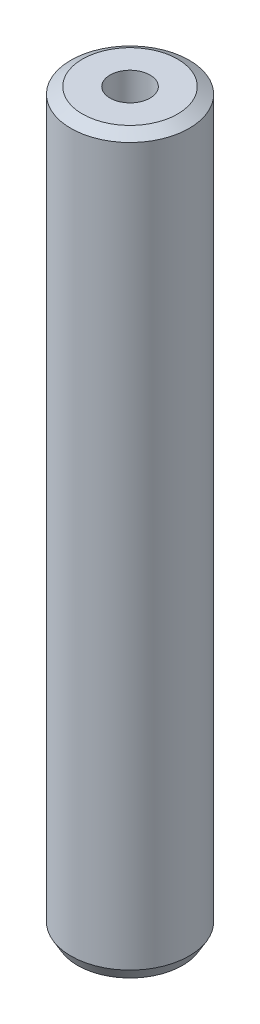
ISO-10303-21;
HEADER;
FILE_DESCRIPTION(('STEP AP214'),'2;1');
FILE_NAME('part.step','',(''),(''),'','','');
FILE_SCHEMA(('AUTOMOTIVE_DESIGN { 1 0 10303 214 1 1 1 1 }'));
ENDSEC;
DATA;
#1=APPLICATION_CONTEXT('core data for automotive mechanical design processes');
#2=APPLICATION_PROTOCOL_DEFINITION('international standard','automotive_design',2000,#1);
#3=PRODUCT_CONTEXT('',#1,'mechanical');
#4=PRODUCT('Part','Part','',(#3));
#5=PRODUCT_RELATED_PRODUCT_CATEGORY('part','',(#4));
#6=PRODUCT_DEFINITION_FORMATION('','',#4);
#7=PRODUCT_DEFINITION_CONTEXT('part definition',#1,'design');
#8=PRODUCT_DEFINITION('design','',#6,#7);
#9=PRODUCT_DEFINITION_SHAPE('','',#8);
#10=(LENGTH_UNIT() NAMED_UNIT(*) SI_UNIT(.MILLI.,.METRE.));
#11=(NAMED_UNIT(*) PLANE_ANGLE_UNIT() SI_UNIT($,.RADIAN.));
#12=(NAMED_UNIT(*) SI_UNIT($,.STERADIAN.) SOLID_ANGLE_UNIT());
#13=UNCERTAINTY_MEASURE_WITH_UNIT(LENGTH_MEASURE(1.E-05),#10,'distance_accuracy_value','');
#14=(GEOMETRIC_REPRESENTATION_CONTEXT(3) GLOBAL_UNCERTAINTY_ASSIGNED_CONTEXT((#13)) GLOBAL_UNIT_ASSIGNED_CONTEXT((#10,
#11,#12)) REPRESENTATION_CONTEXT('',''));
#15=CARTESIAN_POINT('',(0.,0.,0.));
#16=DIRECTION('',(0.,0.,1.));
#17=DIRECTION('',(1.,0.,0.));
#18=AXIS2_PLACEMENT_3D('',#15,#16,#17);
#19=CARTESIAN_POINT('',(0.,465.942837783253,0.));
#20=DIRECTION('',(0.,-1.,0.));
#21=DIRECTION('',(0.,0.,-1.));
#22=AXIS2_PLACEMENT_3D('',#19,#20,#21);
#23=CYLINDRICAL_SURFACE('',#22,37.5);
#24=CARTESIAN_POINT('',(0.,461.716864130824,0.));
#25=DIRECTION('',(0.,1.,0.));
#26=DIRECTION('',(0.,0.,1.));
#27=AXIS2_PLACEMENT_3D('',#24,#25,#26);
#28=CIRCLE('',#27,37.5);
#29=CARTESIAN_POINT('',(0.,461.716864130824,-37.5));
#30=VERTEX_POINT('',#29);
#31=EDGE_CURVE('E50',#30,#30,#28,.F.);
#32=CARTESIAN_POINT('',(0.,7.31960107745549,0.));
#33=DIRECTION('',(0.,1.,0.));
#34=DIRECTION('',(0.,0.,1.));
#35=AXIS2_PLACEMENT_3D('',#32,#33,#34);
#36=CIRCLE('',#35,37.5);
#37=CARTESIAN_POINT('',(0.,7.31960107745544,-37.5));
#38=VERTEX_POINT('',#37);
#39=EDGE_CURVE('E51',#38,#38,#36,.T.);
#40=CARTESIAN_POINT('',(0.,461.716864130824,-37.5));
#41=CARTESIAN_POINT('',(0.,456.983559307351,-37.5));
#42=CARTESIAN_POINT('',(0.,452.250254483879,-37.5));
#43=CARTESIAN_POINT('',(0.,442.783644836934,-37.5));
#44=CARTESIAN_POINT('',(0.,438.050340013461,-37.5));
#45=CARTESIAN_POINT('',(0.,428.583730366516,-37.5));
#46=CARTESIAN_POINT('',(0.,423.850425543043,-37.5));
#47=CARTESIAN_POINT('',(0.,414.383815896098,-37.5));
#48=CARTESIAN_POINT('',(0.,409.650511072625,-37.5));
#49=CARTESIAN_POINT('',(0.,400.18390142568,-37.5));
#50=CARTESIAN_POINT('',(0.,395.450596602208,-37.5));
#51=CARTESIAN_POINT('',(0.,385.983986955263,-37.5));
#52=CARTESIAN_POINT('',(0.,381.25068213179,-37.5));
#53=CARTESIAN_POINT('',(0.,371.784072484845,-37.5));
#54=CARTESIAN_POINT('',(0.,367.050767661372,-37.5));
#55=CARTESIAN_POINT('',(0.,357.584158014427,-37.5));
#56=CARTESIAN_POINT('',(0.,352.850853190954,-37.5));
#57=CARTESIAN_POINT('',(0.,343.384243544009,-37.5));
#58=CARTESIAN_POINT('',(0.,338.650938720537,-37.5));
#59=CARTESIAN_POINT('',(0.,329.184329073591,-37.5));
#60=CARTESIAN_POINT('',(0.,324.451024250119,-37.5));
#61=CARTESIAN_POINT('',(0.,314.984414603174,-37.5));
#62=CARTESIAN_POINT('',(0.,310.251109779701,-37.5));
#63=CARTESIAN_POINT('',(0.,300.784500132756,-37.5));
#64=CARTESIAN_POINT('',(0.,296.051195309283,-37.5));
#65=CARTESIAN_POINT('',(0.,286.584585662338,-37.5));
#66=CARTESIAN_POINT('',(0.,281.851280838866,-37.5));
#67=CARTESIAN_POINT('',(0.,272.38467119192,-37.5));
#68=CARTESIAN_POINT('',(0.,267.651366368448,-37.5));
#69=CARTESIAN_POINT('',(0.,258.184756721503,-37.5));
#70=CARTESIAN_POINT('',(0.,253.45145189803,-37.5));
#71=CARTESIAN_POINT('',(0.,243.984842251085,-37.5));
#72=CARTESIAN_POINT('',(0.,239.251537427612,-37.5));
#73=CARTESIAN_POINT('',(0.,229.784927780667,-37.5));
#74=CARTESIAN_POINT('',(0.,225.051622957194,-37.5));
#75=CARTESIAN_POINT('',(0.,215.585013310249,-37.5));
#76=CARTESIAN_POINT('',(0.,210.851708486777,-37.5));
#77=CARTESIAN_POINT('',(0.,201.385098839832,-37.5));
#78=CARTESIAN_POINT('',(0.,196.651794016359,-37.5));
#79=CARTESIAN_POINT('',(0.,187.185184369414,-37.5));
#80=CARTESIAN_POINT('',(0.,182.451879545941,-37.5));
#81=CARTESIAN_POINT('',(0.,172.985269898996,-37.5));
#82=CARTESIAN_POINT('',(0.,168.251965075523,-37.5));
#83=CARTESIAN_POINT('',(0.,158.785355428578,-37.5));
#84=CARTESIAN_POINT('',(0.,154.052050605106,-37.5));
#85=CARTESIAN_POINT('',(0.,144.585440958161,-37.5));
#86=CARTESIAN_POINT('',(0.,139.852136134688,-37.5));
#87=CARTESIAN_POINT('',(0.,130.385526487743,-37.5));
#88=CARTESIAN_POINT('',(0.,125.65222166427,-37.5));
#89=CARTESIAN_POINT('',(0.,116.185612017325,-37.5));
#90=CARTESIAN_POINT('',(0.,111.452307193852,-37.5));
#91=CARTESIAN_POINT('',(0.,101.985697546907,-37.5));
#92=CARTESIAN_POINT('',(0.,97.2523927234346,-37.5));
#93=CARTESIAN_POINT('',(0.,87.7857830764894,-37.5));
#94=CARTESIAN_POINT('',(0.,83.0524782530169,-37.5));
#95=CARTESIAN_POINT('',(0.,73.5858686060717,-37.5));
#96=CARTESIAN_POINT('',(0.,68.8525637825991,-37.5));
#97=CARTESIAN_POINT('',(0.,59.3859541356539,-37.5));
#98=CARTESIAN_POINT('',(0.,54.6526493121813,-37.5));
#99=CARTESIAN_POINT('',(0.,45.1860396652361,-37.5));
#100=CARTESIAN_POINT('',(0.,40.4527348417635,-37.5));
#101=CARTESIAN_POINT('',(0.,30.9861251948184,-37.5));
#102=CARTESIAN_POINT('',(0.,26.2528203713458,-37.5));
#103=CARTESIAN_POINT('',(0.,16.7862107244006,-37.5));
#104=CARTESIAN_POINT('',(0.,12.052905900928,-37.5));
#105=CARTESIAN_POINT('',(0.,7.31960107745544,-37.5));
#106=B_SPLINE_CURVE_WITH_KNOTS('',3,(#40,#41,#42,#43,#44,#45,#46,#47,#48,#49,#50,#51,#52,#53,
#54,#55,#56,#57,#58,#59,#60,#61,#62,#63,#64,#65,#66,#67,#68,#69,#70,#71,#72,#73,#74,#75,#76,#77,
#78,#79,#80,#81,#82,#83,#84,#85,#86,#87,#88,#89,#90,#91,#92,#93,#94,#95,#96,#97,#98,#99,#100,
#101,#102,#103,#104,#105),.UNSPECIFIED.,.F.,.F.,(4,2,2,2,2,2,2,2,2,2,2,2,2,2,2,2,2,2,2,2,2,2,2,
2,2,2,2,2,2,2,2,2,4),(0.,14.1999144704178,28.3998289408355,42.5997434112533,56.7996578816711,
70.9995723520889,85.1994868225066,99.3994012929244,113.599315763342,127.79923023376,
141.999144704178,156.199059174595,170.398973645013,184.598888115431,198.798802585849,
212.998717056267,227.198631526684,241.398545997102,255.59846046752,269.798374937938,
283.998289408355,298.198203878773,312.398118349191,326.598032819609,340.797947290026,
354.997861760444,369.197776230862,383.39769070128,397.597605171697,411.797519642115,
425.997434112533,440.197348582951,454.397263053369),.UNSPECIFIED.);
#107=EDGE_CURVE('BSEAM39',#30,#38,#106,.T.);
#108=ORIENTED_EDGE('',*,*,#31,.T.);
#109=ORIENTED_EDGE('',*,*,#39,.T.);
#110=ORIENTED_EDGE('',*,*,#107,.T.);
#111=ORIENTED_EDGE('',*,*,#107,.F.);
#112=EDGE_LOOP('',(#108,#110,#109,#111));
#113=FACE_BOUND('',#112,.T.);
#114=ADVANCED_FACE('F39',(#113),#23,.T.);
#115=CARTESIAN_POINT('',(0.,465.942837783253,0.));
#116=DIRECTION('',(0.,1.,0.));
#117=DIRECTION('',(0.,0.,1.));
#118=AXIS2_PLACEMENT_3D('',#115,#116,#117);
#119=PLANE('',#118);
#120=CARTESIAN_POINT('',(0.,465.942837783253,0.));
#121=DIRECTION('',(0.,1.,0.));
#122=DIRECTION('',(0.,0.,1.));
#123=AXIS2_PLACEMENT_3D('',#120,#121,#122);
#124=CIRCLE('',#123,30.1803989225453);
#125=CARTESIAN_POINT('',(0.,465.942837783253,30.1803989225453));
#126=VERTEX_POINT('',#125);
#127=EDGE_CURVE('E54',#126,#126,#124,.T.);
#128=ORIENTED_EDGE('',*,*,#127,.T.);
#129=EDGE_LOOP('',(#128));
#130=FACE_BOUND('',#129,.T.);
#131=CARTESIAN_POINT('',(0.,465.942837783253,0.));
#132=DIRECTION('',(0.,1.,0.));
#133=DIRECTION('',(0.,0.,1.));
#134=AXIS2_PLACEMENT_3D('',#131,#132,#133);
#135=CIRCLE('',#134,12.695700964722);
#136=CARTESIAN_POINT('',(0.,465.942837783253,-12.695700964722));
#137=VERTEX_POINT('',#136);
#138=EDGE_CURVE('E58',#137,#137,#135,.T.);
#139=ORIENTED_EDGE('',*,*,#138,.F.);
#140=EDGE_LOOP('',(#139));
#141=FACE_BOUND('',#140,.T.);
#142=ADVANCED_FACE('F69',(#130,#141),#119,.T.);
#143=CARTESIAN_POINT('',(0.,0.,0.));
#144=DIRECTION('',(0.,1.,0.));
#145=DIRECTION('',(0.,0.,1.));
#146=AXIS2_PLACEMENT_3D('',#143,#144,#145);
#147=PLANE('',#146);
#148=CARTESIAN_POINT('',(0.,0.,0.));
#149=DIRECTION('',(0.,1.,0.));
#150=DIRECTION('',(0.,0.,1.));
#151=AXIS2_PLACEMENT_3D('',#148,#149,#150);
#152=CIRCLE('',#151,33.2740263475704);
#153=CARTESIAN_POINT('',(0.,0.,33.2740263475704));
#154=VERTEX_POINT('',#153);
#155=EDGE_CURVE('E10',#154,#154,#152,.F.);
#156=ORIENTED_EDGE('',*,*,#155,.T.);
#157=EDGE_LOOP('',(#156));
#158=FACE_BOUND('',#157,.T.);
#159=CARTESIAN_POINT('',(0.,0.,0.));
#160=DIRECTION('',(0.,1.,0.));
#161=DIRECTION('',(0.,0.,1.));
#162=AXIS2_PLACEMENT_3D('',#159,#160,#161);
#163=CIRCLE('',#162,12.695700964722);
#164=CARTESIAN_POINT('',(0.,0.,-12.695700964722));
#165=VERTEX_POINT('',#164);
#166=EDGE_CURVE('E63',#165,#165,#163,.T.);
#167=ORIENTED_EDGE('',*,*,#166,.T.);
#168=EDGE_LOOP('',(#167));
#169=FACE_BOUND('',#168,.T.);
#170=ADVANCED_FACE('F75',(#158,#169),#147,.F.);
#171=CARTESIAN_POINT('',(0.,465.942837783253,0.));
#172=DIRECTION('',(0.,-1.,0.));
#173=DIRECTION('',(0.,0.,-1.));
#174=AXIS2_PLACEMENT_3D('',#171,#172,#173);
#175=CYLINDRICAL_SURFACE('',#174,12.695700964722);
#176=CARTESIAN_POINT('',(0.,465.942837783253,-12.695700964722));
#177=CARTESIAN_POINT('',(0.,461.089266556344,-12.695700964722));
#178=CARTESIAN_POINT('',(0.,456.235695329435,-12.695700964722));
#179=CARTESIAN_POINT('',(0.,446.528552875618,-12.695700964722));
#180=CARTESIAN_POINT('',(0.,441.674981648709,-12.695700964722));
#181=CARTESIAN_POINT('',(0.,431.967839194891,-12.695700964722));
#182=CARTESIAN_POINT('',(0.,427.114267967982,-12.695700964722));
#183=CARTESIAN_POINT('',(0.,417.407125514164,-12.695700964722));
#184=CARTESIAN_POINT('',(0.,412.553554287255,-12.695700964722));
#185=CARTESIAN_POINT('',(0.,402.846411833438,-12.695700964722));
#186=CARTESIAN_POINT('',(0.,397.992840606529,-12.695700964722));
#187=CARTESIAN_POINT('',(0.,388.285698152711,-12.695700964722));
#188=CARTESIAN_POINT('',(0.,383.432126925802,-12.695700964722));
#189=CARTESIAN_POINT('',(0.,373.724984471984,-12.695700964722));
#190=CARTESIAN_POINT('',(0.,368.871413245075,-12.695700964722));
#191=CARTESIAN_POINT('',(0.,359.164270791258,-12.695700964722));
#192=CARTESIAN_POINT('',(0.,354.310699564349,-12.695700964722));
#193=CARTESIAN_POINT('',(0.,344.603557110531,-12.695700964722));
#194=CARTESIAN_POINT('',(0.,339.749985883622,-12.695700964722));
#195=CARTESIAN_POINT('',(0.,330.042843429804,-12.695700964722));
#196=CARTESIAN_POINT('',(0.,325.189272202895,-12.695700964722));
#197=CARTESIAN_POINT('',(0.,315.482129749078,-12.695700964722));
#198=CARTESIAN_POINT('',(0.,310.628558522169,-12.695700964722));
#199=CARTESIAN_POINT('',(0.,300.921416068351,-12.695700964722));
#200=CARTESIAN_POINT('',(0.,296.067844841442,-12.695700964722));
#201=CARTESIAN_POINT('',(0.,286.360702387624,-12.695700964722));
#202=CARTESIAN_POINT('',(0.,281.507131160715,-12.695700964722));
#203=CARTESIAN_POINT('',(0.,271.799988706898,-12.695700964722));
#204=CARTESIAN_POINT('',(0.,266.946417479989,-12.695700964722));
#205=CARTESIAN_POINT('',(0.,257.239275026171,-12.695700964722));
#206=CARTESIAN_POINT('',(0.,252.385703799262,-12.695700964722));
#207=CARTESIAN_POINT('',(0.,242.678561345444,-12.695700964722));
#208=CARTESIAN_POINT('',(0.,237.824990118535,-12.695700964722));
#209=CARTESIAN_POINT('',(0.,228.117847664718,-12.695700964722));
#210=CARTESIAN_POINT('',(0.,223.264276437809,-12.695700964722));
#211=CARTESIAN_POINT('',(0.,213.557133983991,-12.695700964722));
#212=CARTESIAN_POINT('',(0.,208.703562757082,-12.695700964722));
#213=CARTESIAN_POINT('',(0.,198.996420303264,-12.695700964722));
#214=CARTESIAN_POINT('',(0.,194.142849076355,-12.695700964722));
#215=CARTESIAN_POINT('',(0.,184.435706622538,-12.695700964722));
#216=CARTESIAN_POINT('',(0.,179.582135395629,-12.695700964722));
#217=CARTESIAN_POINT('',(0.,169.874992941811,-12.695700964722));
#218=CARTESIAN_POINT('',(0.,165.021421714902,-12.695700964722));
#219=CARTESIAN_POINT('',(0.,155.314279261084,-12.695700964722));
#220=CARTESIAN_POINT('',(0.,150.460708034175,-12.695700964722));
#221=CARTESIAN_POINT('',(0.,140.753565580358,-12.695700964722));
#222=CARTESIAN_POINT('',(0.,135.899994353449,-12.695700964722));
#223=CARTESIAN_POINT('',(0.,126.192851899631,-12.695700964722));
#224=CARTESIAN_POINT('',(0.,121.339280672722,-12.695700964722));
#225=CARTESIAN_POINT('',(0.,111.632138218904,-12.695700964722));
#226=CARTESIAN_POINT('',(0.,106.778566991996,-12.695700964722));
#227=CARTESIAN_POINT('',(0.,97.0714245381777,-12.695700964722));
#228=CARTESIAN_POINT('',(0.,92.2178533112689,-12.695700964722));
#229=CARTESIAN_POINT('',(0.,82.5107108574511,-12.695700964722));
#230=CARTESIAN_POINT('',(0.,77.6571396305422,-12.695700964722));
#231=CARTESIAN_POINT('',(0.,67.9499971767244,-12.695700964722));
#232=CARTESIAN_POINT('',(0.,63.0964259498155,-12.695700964722));
#233=CARTESIAN_POINT('',(0.,53.3892834959978,-12.695700964722));
#234=CARTESIAN_POINT('',(0.,48.5357122690889,-12.695700964722));
#235=CARTESIAN_POINT('',(0.,38.8285698152711,-12.695700964722));
#236=CARTESIAN_POINT('',(0.,33.9749985883622,-12.695700964722));
#237=CARTESIAN_POINT('',(0.,24.2678561345444,-12.695700964722));
#238=CARTESIAN_POINT('',(0.,19.4142849076355,-12.695700964722));
#239=CARTESIAN_POINT('',(0.,9.70714245381776,-12.695700964722));
#240=CARTESIAN_POINT('',(0.,4.85357122690888,-12.695700964722));
#241=CARTESIAN_POINT('',(0.,0.,-12.695700964722));
#242=B_SPLINE_CURVE_WITH_KNOTS('',3,(#176,#177,#178,#179,#180,#181,#182,#183,#184,#185,#186,
#187,#188,#189,#190,#191,#192,#193,#194,#195,#196,#197,#198,#199,#200,#201,#202,#203,#204,#205,
#206,#207,#208,#209,#210,#211,#212,#213,#214,#215,#216,#217,#218,#219,#220,#221,#222,#223,#224,
#225,#226,#227,#228,#229,#230,#231,#232,#233,#234,#235,#236,#237,#238,#239,#240,#241),
.UNSPECIFIED.,.F.,.F.,(4,2,2,2,2,2,2,2,2,2,2,2,2,2,2,2,2,2,2,2,2,2,2,2,2,2,2,2,2,2,2,2,4),(0.,
14.5607136807267,29.1214273614533,43.68214104218,58.2428547229067,72.8035684036333,
87.36428208436,101.924995765087,116.485709445813,131.04642312654,145.607136807267,
160.167850487993,174.72856416872,189.289277849447,203.849991530173,218.4107052109,
232.971418891627,247.532132572353,262.09284625308,276.653559933807,291.214273614533,
305.77498729526,320.335700975987,334.896414656713,349.45712833744,364.017842018167,
378.578555698893,393.13926937962,407.699983060346,422.260696741073,436.8214104218,
451.382124102526,465.942837783253),.UNSPECIFIED.);
#243=EDGE_CURVE('BSEAM70',#137,#165,#242,.T.);
#244=ORIENTED_EDGE('',*,*,#138,.T.);
#245=ORIENTED_EDGE('',*,*,#166,.F.);
#246=ORIENTED_EDGE('',*,*,#243,.T.);
#247=ORIENTED_EDGE('',*,*,#243,.F.);
#248=EDGE_LOOP('',(#244,#246,#245,#247));
#249=FACE_BOUND('',#248,.T.);
#250=ADVANCED_FACE('F70',(#249),#175,.F.);
#251=CARTESIAN_POINT('',(0.,465.942837783253,0.));
#252=DIRECTION('',(0.,-1.,0.));
#253=DIRECTION('',(0.,0.,-1.));
#254=AXIS2_PLACEMENT_3D('',#251,#252,#253);
#255=CONICAL_SURFACE('',#254,30.1803989225453,1.0471975511966);
#256=ORIENTED_EDGE('',*,*,#31,.F.);
#257=EDGE_LOOP('',(#256));
#258=FACE_BOUND('',#257,.T.);
#259=ORIENTED_EDGE('',*,*,#127,.F.);
#260=EDGE_LOOP('',(#259));
#261=FACE_BOUND('',#260,.T.);
#262=ADVANCED_FACE('F81',(#258,#261),#255,.T.);
#263=CARTESIAN_POINT('',(0.,7.31960107745549,0.));
#264=DIRECTION('',(0.,1.,0.));
#265=DIRECTION('',(0.,0.,1.));
#266=AXIS2_PLACEMENT_3D('',#263,#264,#265);
#267=CONICAL_SURFACE('',#266,37.5,0.5235987755983);
#268=ORIENTED_EDGE('',*,*,#155,.F.);
#269=EDGE_LOOP('',(#268));
#270=FACE_BOUND('',#269,.T.);
#271=ORIENTED_EDGE('',*,*,#39,.F.);
#272=EDGE_LOOP('',(#271));
#273=FACE_BOUND('',#272,.T.);
#274=ADVANCED_FACE('F45',(#270,#273),#267,.T.);
#275=CLOSED_SHELL('',(#114,#142,#170,#250,#262,#274));
#276=MANIFOLD_SOLID_BREP('B2',#275);
#277=ADVANCED_BREP_SHAPE_REPRESENTATION('',(#18,#276),#14);
#278=SHAPE_DEFINITION_REPRESENTATION(#9,#277);
ENDSEC;
END-ISO-10303-21;
